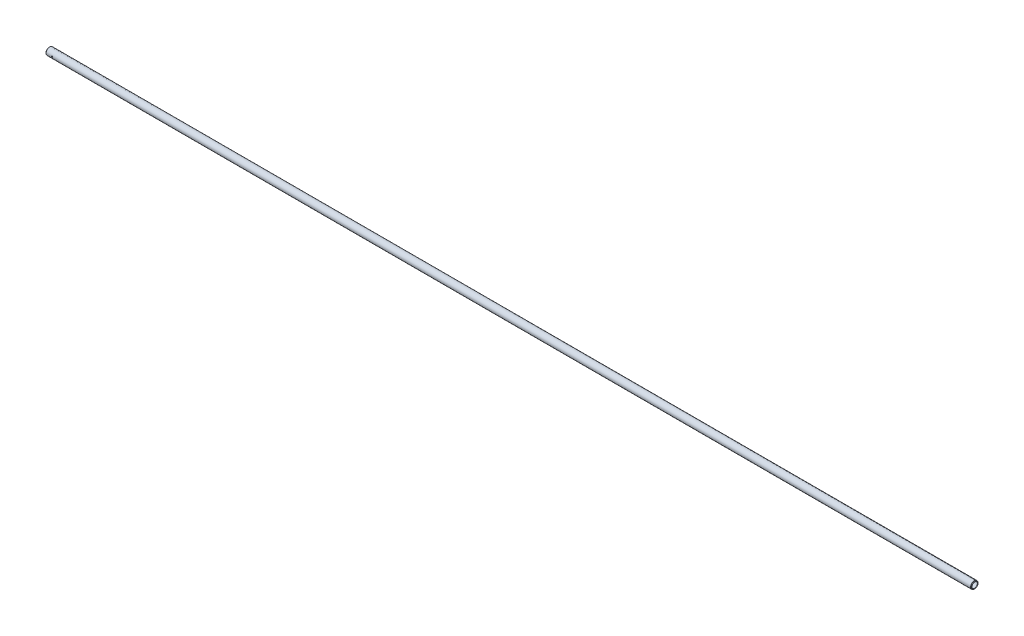
ISO-10303-21;
HEADER;
FILE_DESCRIPTION(('STEP AP214'),'2;1');
FILE_NAME('part.step','',(''),(''),'','','');
FILE_SCHEMA(('AUTOMOTIVE_DESIGN { 1 0 10303 214 1 1 1 1 }'));
ENDSEC;
DATA;
#1=APPLICATION_CONTEXT('core data for automotive mechanical design processes');
#2=APPLICATION_PROTOCOL_DEFINITION('international standard','automotive_design',2000,#1);
#3=PRODUCT_CONTEXT('',#1,'mechanical');
#4=PRODUCT('Part','Part','',(#3));
#5=PRODUCT_RELATED_PRODUCT_CATEGORY('part','',(#4));
#6=PRODUCT_DEFINITION_FORMATION('','',#4);
#7=PRODUCT_DEFINITION_CONTEXT('part definition',#1,'design');
#8=PRODUCT_DEFINITION('design','',#6,#7);
#9=PRODUCT_DEFINITION_SHAPE('','',#8);
#10=(LENGTH_UNIT() NAMED_UNIT(*) SI_UNIT(.MILLI.,.METRE.));
#11=(NAMED_UNIT(*) PLANE_ANGLE_UNIT() SI_UNIT($,.RADIAN.));
#12=(NAMED_UNIT(*) SI_UNIT($,.STERADIAN.) SOLID_ANGLE_UNIT());
#13=UNCERTAINTY_MEASURE_WITH_UNIT(LENGTH_MEASURE(1.E-05),#10,'distance_accuracy_value','');
#14=(GEOMETRIC_REPRESENTATION_CONTEXT(3) GLOBAL_UNCERTAINTY_ASSIGNED_CONTEXT((#13)) GLOBAL_UNIT_ASSIGNED_CONTEXT((#10,
#11,#12)) REPRESENTATION_CONTEXT('',''));
#15=CARTESIAN_POINT('',(0.,0.,0.));
#16=DIRECTION('',(0.,0.,1.));
#17=DIRECTION('',(1.,0.,0.));
#18=AXIS2_PLACEMENT_3D('',#15,#16,#17);
#19=CARTESIAN_POINT('',(1156.6271,0.,0.));
#20=DIRECTION('',(-1.,0.,0.));
#21=DIRECTION('',(0.,0.,1.));
#22=AXIS2_PLACEMENT_3D('',#19,#20,#21);
#23=CYLINDRICAL_SURFACE('',#22,4.08305);
#24=CARTESIAN_POINT('',(0.558800000000081,0.,0.));
#25=DIRECTION('',(-1.,0.,0.));
#26=DIRECTION('',(0.,0.,1.));
#27=AXIS2_PLACEMENT_3D('',#24,#25,#26);
#28=CIRCLE('',#27,4.08305);
#29=CARTESIAN_POINT('',(0.558800000000081,0.,4.08305));
#30=VERTEX_POINT('',#29);
#31=EDGE_CURVE('E57',#30,#30,#28,.T.);
#32=ORIENTED_EDGE('',*,*,#31,.T.);
#33=EDGE_LOOP('',(#32));
#34=FACE_BOUND('',#33,.T.);
#35=CARTESIAN_POINT('',(1156.0683,0.,0.));
#36=DIRECTION('',(-1.,0.,0.));
#37=DIRECTION('',(0.,0.,1.));
#38=AXIS2_PLACEMENT_3D('',#35,#36,#37);
#39=CIRCLE('',#38,4.08305);
#40=CARTESIAN_POINT('',(1156.0683,0.,4.08305));
#41=VERTEX_POINT('',#40);
#42=EDGE_CURVE('E60',#41,#41,#39,.T.);
#43=ORIENTED_EDGE('',*,*,#42,.F.);
#44=EDGE_LOOP('',(#43));
#45=FACE_BOUND('',#44,.T.);
#46=CARTESIAN_POINT('',(8.48360000000004,0.,4.08305));
#47=CARTESIAN_POINT('',(8.48359835195724,-0.0437936344189823,4.08304919974877));
#48=CARTESIAN_POINT('',(8.47993408105671,-0.0876084524201756,4.08233816632306));
#49=CARTESIAN_POINT('',(8.46538417488533,-0.174001819702679,4.07957026755408));
#50=CARTESIAN_POINT('',(8.45449259524058,-0.216579321191741,4.07751229438825));
#51=CARTESIAN_POINT('',(8.42583526652717,-0.299236266507052,4.07228055510989));
#52=CARTESIAN_POINT('',(8.40807588417276,-0.339317984181105,4.06910782266995));
#53=CARTESIAN_POINT('',(8.36620550580085,-0.415929567273147,4.06199237015643));
#54=CARTESIAN_POINT('',(8.34209496655685,-0.452459687862477,4.05804970546146));
#55=CARTESIAN_POINT('',(8.28788347201868,-0.521395994045053,4.04977333858839));
#56=CARTESIAN_POINT('',(8.25771780427946,-0.553750824259303,4.04543571561407));
#57=CARTESIAN_POINT('',(8.19239151171186,-0.612973668880685,4.03688716636423));
#58=CARTESIAN_POINT('',(8.15723051551213,-0.639841274984794,4.03267624953674));
#59=CARTESIAN_POINT('',(8.08254599955123,-0.687542698736716,4.0248197059621));
#60=CARTESIAN_POINT('',(8.04298828363569,-0.708323881900835,4.02117913015663));
#61=CARTESIAN_POINT('',(7.96086101610945,-0.742925508771729,4.01493090011621));
#62=CARTESIAN_POINT('',(7.91829174043,-0.756746589251585,4.01232315139357));
#63=CARTESIAN_POINT('',(7.83190052744974,-0.77687006133666,4.00847538546546));
#64=CARTESIAN_POINT('',(7.78810024710716,-0.783262244363182,4.0072190481824));
#65=CARTESIAN_POINT('',(7.7000322662954,-0.788625259864484,4.00616718302077));
#66=CARTESIAN_POINT('',(7.65576461060103,-0.787596796913966,4.00637151645457));
#67=CARTESIAN_POINT('',(7.56867168576739,-0.778220434855247,4.00820305985024));
#68=CARTESIAN_POINT('',(7.52583490586966,-0.76997498662024,4.00981035280903));
#69=CARTESIAN_POINT('',(7.44216430373261,-0.746560212158085,4.01423539756978));
#70=CARTESIAN_POINT('',(7.40133057114312,-0.731390576339592,4.01705320349536));
#71=CARTESIAN_POINT('',(7.32252731625151,-0.694458841021243,4.02360240659366));
#72=CARTESIAN_POINT('',(7.28457752130453,-0.672655693384622,4.02733946369727));
#73=CARTESIAN_POINT('',(7.21283663474116,-0.623104847461146,4.03530240057001));
#74=CARTESIAN_POINT('',(7.17904598933934,-0.595356512218259,4.03952833269392));
#75=CARTESIAN_POINT('',(7.11599098103806,-0.534152205023734,4.04807943821777));
#76=CARTESIAN_POINT('',(7.08681159779974,-0.500608682283266,4.05240509062216));
#77=CARTESIAN_POINT('',(7.03448086817903,-0.429058288709583,4.06060350875623));
#78=CARTESIAN_POINT('',(7.01132958905603,-0.391051368082271,4.06447626943244));
#79=CARTESIAN_POINT('',(6.97169838664311,-0.311561996442477,4.0713410630523));
#80=CARTESIAN_POINT('',(6.95522766956537,-0.270074843774468,4.07433187908588));
#81=CARTESIAN_POINT('',(6.92951301818015,-0.184852005608387,4.07908646983238));
#82=CARTESIAN_POINT('',(6.92026827100975,-0.14111657361356,4.0808503825595));
#83=CARTESIAN_POINT('',(6.90938711870488,-0.0533694181846439,4.08293335335446));
#84=CARTESIAN_POINT('',(6.90763433733887,-0.00937263398596386,4.08327450971812));
#85=CARTESIAN_POINT('',(6.91147417957213,0.0782852544433916,4.08253471293466));
#86=CARTESIAN_POINT('',(6.91706642050063,0.121946376042663,4.08145383387463));
#87=CARTESIAN_POINT('',(6.93534083660303,0.207321779676394,4.07800520422727));
#88=CARTESIAN_POINT('',(6.94796377800441,0.249049213016555,4.07564820951119));
#89=CARTESIAN_POINT('',(6.97987691246763,0.329795385236145,4.06991058909967));
#90=CARTESIAN_POINT('',(6.99916757829879,0.368813931808628,4.06652989082153));
#91=CARTESIAN_POINT('',(7.04412369970402,0.443528942367239,4.05906476357752));
#92=CARTESIAN_POINT('',(7.06985982649908,0.479182104559914,4.05497269805924));
#93=CARTESIAN_POINT('',(7.12688110870752,0.545705421390549,4.04655769873302));
#94=CARTESIAN_POINT('',(7.15816681440034,0.576575101143648,4.04223474206036));
#95=CARTESIAN_POINT('',(7.22592727552292,0.633100311742506,4.03377137624205));
#96=CARTESIAN_POINT('',(7.26246895201072,0.658676220685622,4.02963439872249));
#97=CARTESIAN_POINT('',(7.33939821996473,0.703327042099058,4.02208196015369));
#98=CARTESIAN_POINT('',(7.37978566354493,0.722402204421516,4.01866647137642));
#99=CARTESIAN_POINT('',(7.46306349579979,0.753398922517765,4.01297098512968));
#100=CARTESIAN_POINT('',(7.50594021700063,0.765356111849477,4.01068534143271));
#101=CARTESIAN_POINT('',(7.59314260188912,0.781886620041761,4.00749582041581));
#102=CARTESIAN_POINT('',(7.63746809083888,0.786460826045708,4.00659177708269));
#103=CARTESIAN_POINT('',(7.72551145378198,0.788064507393609,4.00627657296743));
#104=CARTESIAN_POINT('',(7.7692269984212,0.785219667989717,4.00684054243296));
#105=CARTESIAN_POINT('',(7.85554410908808,0.772342115181789,4.00934249603243));
#106=CARTESIAN_POINT('',(7.89814568270374,0.762309450752035,4.01128047080458));
#107=CARTESIAN_POINT('',(7.98095274124203,0.735395356982123,4.01630132737775));
#108=CARTESIAN_POINT('',(8.02116305151539,0.718528296610042,4.01938180597943));
#109=CARTESIAN_POINT('',(8.09820295037004,0.678438228458858,4.02634213533605));
#110=CARTESIAN_POINT('',(8.13503228088293,0.655214736034405,4.03022204703808));
#111=CARTESIAN_POINT('',(8.20489278875161,0.602637303179895,4.0384208109495));
#112=CARTESIAN_POINT('',(8.23785465657996,0.57319218541361,4.04274563650558));
#113=CARTESIAN_POINT('',(8.29841131313612,0.509196692661865,4.05130301207866));
#114=CARTESIAN_POINT('',(8.32600486737644,0.474645146618343,4.05553554067301));
#115=CARTESIAN_POINT('',(8.37529048033091,0.401019283517835,4.06347924655966));
#116=CARTESIAN_POINT('',(8.39692328475516,0.361904697981703,4.06718502347692));
#117=CARTESIAN_POINT('',(8.43327524597784,0.280536295709282,4.07360479031343));
#118=CARTESIAN_POINT('',(8.44800078686978,0.238285419723786,4.07631969553658));
#119=CARTESIAN_POINT('',(8.46718809046656,0.163268679567907,4.07990923899093));
#120=CARTESIAN_POINT('',(8.4733318487948,0.130936667131422,4.08108027210182));
#121=CARTESIAN_POINT('',(8.48153836498294,0.065740405913157,4.08265094217566));
#122=CARTESIAN_POINT('',(8.48360123719671,0.0328761720712113,4.08305060075392));
#123=CARTESIAN_POINT('',(8.48360000000004,0.,4.08305));
#124=B_SPLINE_CURVE_WITH_KNOTS('',3,(#46,#47,#48,#49,#50,#51,#52,#53,#54,#55,#56,#57,#58,#59,
#60,#61,#62,#63,#64,#65,#66,#67,#68,#69,#70,#71,#72,#73,#74,#75,#76,#77,#78,#79,#80,#81,#82,#83,
#84,#85,#86,#87,#88,#89,#90,#91,#92,#93,#94,#95,#96,#97,#98,#99,#100,#101,#102,#103,#104,#105,
#106,#107,#108,#109,#110,#111,#112,#113,#114,#115,#116,#117,#118,#119,#120,#121,#122,#123),
.UNSPECIFIED.,.T.,.F.,(4,2,2,2,2,2,2,2,2,2,2,2,2,2,2,2,2,2,2,2,2,2,2,2,2,2,2,2,2,2,2,2,2,2,2,2,
2,2,4),(0.,0.131260656054915,0.262629406447818,0.393876663832997,0.525114484526691,
0.657837688787557,0.790570765354721,0.924419923013575,1.05825683271639,1.19045868548511,
1.32264798613163,1.45299064480538,1.58333913187584,1.71451121118051,1.84569735104467,
1.97907353085009,2.11245119875435,2.24601204959702,2.37955787376561,2.51102155256385,
2.64247838246389,2.77284408281307,2.90321902852779,3.03509135907602,3.16697677300195,
3.30072101699543,3.4344601200325,3.56752394993548,3.70057178962414,3.83138037883361,
3.96218807678659,4.09272217355082,4.22326622564433,4.35587562612994,4.48851548527764,
4.62242986076684,4.75622021974921,4.85476122692794,4.95329947276878),.UNSPECIFIED.);
#125=CARTESIAN_POINT('',(8.48360000000004,0.,4.08305));
#126=VERTEX_POINT('',#125);
#127=EDGE_CURVE('E90',#126,#126,#124,.T.);
#128=ORIENTED_EDGE('',*,*,#127,.F.);
#129=EDGE_LOOP('',(#128));
#130=FACE_BOUND('',#129,.T.);
#131=ADVANCED_FACE('F33',(#34,#45,#130),#23,.F.);
#132=CARTESIAN_POINT('',(1156.6271,0.,0.));
#133=DIRECTION('',(-1.,0.,0.));
#134=DIRECTION('',(0.,0.,1.));
#135=AXIS2_PLACEMENT_3D('',#132,#133,#134);
#136=CYLINDRICAL_SURFACE('',#135,4.55930000000007);
#137=CARTESIAN_POINT('',(0.476249999999956,0.,0.));
#138=DIRECTION('',(-1.,0.,0.));
#139=DIRECTION('',(0.,0.,1.));
#140=AXIS2_PLACEMENT_3D('',#137,#138,#139);
#141=CIRCLE('',#140,4.5593);
#142=CARTESIAN_POINT('',(0.476249999999956,0.,4.5593));
#143=VERTEX_POINT('',#142);
#144=EDGE_CURVE('E81',#143,#143,#141,.T.);
#145=ORIENTED_EDGE('',*,*,#144,.F.);
#146=EDGE_LOOP('',(#145));
#147=FACE_BOUND('',#146,.T.);
#148=CARTESIAN_POINT('',(1156.15085000001,0.,0.));
#149=DIRECTION('',(-1.,0.,0.));
#150=DIRECTION('',(0.,0.,1.));
#151=AXIS2_PLACEMENT_3D('',#148,#149,#150);
#152=CIRCLE('',#151,4.55930000000015);
#153=CARTESIAN_POINT('',(1156.15085000001,0.,4.55930000000015));
#154=VERTEX_POINT('',#153);
#155=EDGE_CURVE('E78',#154,#154,#152,.T.);
#156=ORIENTED_EDGE('',*,*,#155,.T.);
#157=EDGE_LOOP('',(#156));
#158=FACE_BOUND('',#157,.T.);
#159=CARTESIAN_POINT('',(6.9088,0.,4.55930000000007));
#160=CARTESIAN_POINT('',(6.90880173788357,-0.0438787900934352,4.55929923353621));
#161=CARTESIAN_POINT('',(6.91248018742963,-0.0877809369843039,4.55865998246218));
#162=CARTESIAN_POINT('',(6.92708974630305,-0.174352292677961,4.55617145528336));
#163=CARTESIAN_POINT('',(6.93802737257788,-0.217020357627615,4.55432109191954));
#164=CARTESIAN_POINT('',(6.96681384540086,-0.299858653552695,4.54961772861648));
#165=CARTESIAN_POINT('',(6.98465687382452,-0.340030954346273,4.54676557292063));
#166=CARTESIAN_POINT('',(7.02673205191729,-0.41680684379291,4.54037162792106));
#167=CARTESIAN_POINT('',(7.05096353075956,-0.453410806591088,4.53682991103574));
#168=CARTESIAN_POINT('',(7.10539140319116,-0.522390296598196,4.52940846554749));
#169=CARTESIAN_POINT('',(7.13564041313099,-0.554724010397864,4.52552593738847));
#170=CARTESIAN_POINT('',(7.20113144986572,-0.613883826469434,4.51788169940716));
#171=CARTESIAN_POINT('',(7.23637380319597,-0.640709568271076,4.51411999750594));
#172=CARTESIAN_POINT('',(7.31114068119446,-0.688261307181512,4.50711619415512));
#173=CARTESIAN_POINT('',(7.35069208294203,-0.70894562384832,4.50387770829871));
#174=CARTESIAN_POINT('',(7.43277339434947,-0.743360744349523,4.49832603164418));
#175=CARTESIAN_POINT('',(7.47530308726337,-0.757092053593581,4.49601277359439));
#176=CARTESIAN_POINT('',(7.56168928316079,-0.777078944161335,4.4926014298857));
#177=CARTESIAN_POINT('',(7.60552856223666,-0.783406923968186,4.49149158382677));
#178=CARTESIAN_POINT('',(7.69365962128154,-0.78863206960421,4.49057718501921));
#179=CARTESIAN_POINT('',(7.73795136660974,-0.787529800098345,4.4907725330818));
#180=CARTESIAN_POINT('',(7.8252111356648,-0.777984633269266,4.49243572132274));
#181=CARTESIAN_POINT('',(7.86818839492277,-0.76962333990557,4.49388941499226));
#182=CARTESIAN_POINT('',(7.95212078342672,-0.745925661314894,4.49788333503316));
#183=CARTESIAN_POINT('',(7.99307583861122,-0.730589020831555,4.50042360116645));
#184=CARTESIAN_POINT('',(8.0720440118033,-0.693294083354735,4.50631958692552));
#185=CARTESIAN_POINT('',(8.11004092885805,-0.671302161271533,4.50967943025437));
#186=CARTESIAN_POINT('',(8.18183610347961,-0.621344777516162,4.51683317719874));
#187=CARTESIAN_POINT('',(8.2156339974003,-0.593378799045016,4.52062711835366));
#188=CARTESIAN_POINT('',(8.27854385126821,-0.531823825442162,4.5282835963603));
#189=CARTESIAN_POINT('',(8.30758737594874,-0.498164874202758,4.53214637364789));
#190=CARTESIAN_POINT('',(8.35962497710523,-0.426415303229937,4.5394586362793));
#191=CARTESIAN_POINT('',(8.38261900908187,-0.388324650900455,4.54290811858287));
#192=CARTESIAN_POINT('',(8.42191220004142,-0.308726630945105,4.54901057156252));
#193=CARTESIAN_POINT('',(8.438205015904,-0.267216070558901,4.55166278693955));
#194=CARTESIAN_POINT('',(8.46356819959517,-0.181991605697949,4.55586588028001));
#195=CARTESIAN_POINT('',(8.47263921676209,-0.138277899691968,4.55741685725846));
#196=CARTESIAN_POINT('',(8.48320784871207,-0.0504775616651755,4.55922932700289));
#197=CARTESIAN_POINT('',(8.48479935994239,-0.00640255077836448,4.55950680600306));
#198=CARTESIAN_POINT('',(8.48061456137249,0.0813841709335896,4.55878490443551));
#199=CARTESIAN_POINT('',(8.47483855673372,0.12509589673047,4.55778557675294));
#200=CARTESIAN_POINT('',(8.45616077958018,0.210623034531852,4.55463225936082));
#201=CARTESIAN_POINT('',(8.44330577902661,0.252448964527875,4.55248585129895));
#202=CARTESIAN_POINT('',(8.41088498603065,0.333352024912502,4.54727805560056));
#203=CARTESIAN_POINT('',(8.39131879400666,0.372428991461956,4.5442166134847));
#204=CARTESIAN_POINT('',(8.34581799505181,0.447130754480508,4.53747859942565));
#205=CARTESIAN_POINT('',(8.3198250897917,0.482719533173578,4.53379650052401));
#206=CARTESIAN_POINT('',(8.26228853544257,0.549063646557849,4.52624154746749));
#207=CARTESIAN_POINT('',(8.23074445147513,0.579818602210547,4.52236867838482));
#208=CARTESIAN_POINT('',(8.16257869763466,0.635972549386746,4.51481661249048));
#209=CARTESIAN_POINT('',(8.12590427541414,0.66130791700256,4.51114006038156));
#210=CARTESIAN_POINT('',(8.04876488870884,0.705458337657419,4.50444732852059));
#211=CARTESIAN_POINT('',(8.00830005068168,0.724273608124612,4.50143112674883));
#212=CARTESIAN_POINT('',(7.92490181502537,0.754755945844598,4.49642070180106));
#213=CARTESIAN_POINT('',(7.88198001463222,0.766453982667553,4.49442205717205));
#214=CARTESIAN_POINT('',(7.79474306677856,0.782466746567234,4.4916622146107));
#215=CARTESIAN_POINT('',(7.75042805071584,0.78678216780306,4.49090090033726));
#216=CARTESIAN_POINT('',(7.6622984592408,0.787886756489596,4.49070718207796));
#217=CARTESIAN_POINT('',(7.61848514660811,0.784776124527753,4.49125708556024));
#218=CARTESIAN_POINT('',(7.5320154781723,0.771334325366263,4.49358494042037));
#219=CARTESIAN_POINT('',(7.48935911780055,0.761003186683537,4.49536288694814));
#220=CARTESIAN_POINT('',(7.40645718548201,0.73345312746822,4.49993956987469));
#221=CARTESIAN_POINT('',(7.36620845948053,0.716243455691915,4.50273693513685));
#222=CARTESIAN_POINT('',(7.28915337849649,0.675435310315805,4.50903848231052));
#223=CARTESIAN_POINT('',(7.25234721490281,0.651836481795205,4.51254270348547));
#224=CARTESIAN_POINT('',(7.1827169833407,0.598564857782336,4.5199188942483));
#225=CARTESIAN_POINT('',(7.1499495776925,0.568818558610237,4.52379497772685));
#226=CARTESIAN_POINT('',(7.08983737931834,0.504250969968621,4.53144592165509));
#227=CARTESIAN_POINT('',(7.06249383738638,0.469428513094012,4.53522075858321));
#228=CARTESIAN_POINT('',(7.01381753322901,0.395387001782438,4.54227670178684));
#229=CARTESIAN_POINT('',(6.9925312115866,0.356137039272709,4.54555390803264));
#230=CARTESIAN_POINT('',(6.95688744867501,0.274576761939379,4.55120738787061));
#231=CARTESIAN_POINT('',(6.94252321488556,0.232269494279871,4.55358454417256));
#232=CARTESIAN_POINT('',(6.92419365868989,0.158173717552972,4.55666073631601));
#233=CARTESIAN_POINT('',(6.91843045127705,0.126829512472878,4.55764508784359));
#234=CARTESIAN_POINT('',(6.91073302843319,0.0636609640193508,4.55896499147861));
#235=CARTESIAN_POINT('',(6.90879873906377,0.0318366299294147,4.55930055611446));
#236=CARTESIAN_POINT('',(6.9088,0.,4.55930000000007));
#237=B_SPLINE_CURVE_WITH_KNOTS('',3,(#159,#160,#161,#162,#163,#164,#165,#166,#167,#168,#169,
#170,#171,#172,#173,#174,#175,#176,#177,#178,#179,#180,#181,#182,#183,#184,#185,#186,#187,#188,
#189,#190,#191,#192,#193,#194,#195,#196,#197,#198,#199,#200,#201,#202,#203,#204,#205,#206,#207,
#208,#209,#210,#211,#212,#213,#214,#215,#216,#217,#218,#219,#220,#221,#222,#223,#224,#225,#226,
#227,#228,#229,#230,#231,#232,#233,#234,#235,#236),.UNSPECIFIED.,.T.,.F.,(4,2,2,2,2,2,2,2,2,2,2,
2,2,2,2,2,2,2,2,2,2,2,2,2,2,2,2,2,2,2,2,2,2,2,2,2,2,2,4),(0.,0.131519982800701,0.26315819805918,
0.394685742578751,0.526199481388945,0.658918145413018,0.791645492468371,0.925254054558016,
1.05885290333206,1.19113404545616,1.32340513493186,1.45420824554892,1.58501614316969,
1.71649629145712,1.84798781833529,1.98123133306715,2.11447582789417,2.24784615830952,
2.38120449555626,2.51288412112274,2.64455829271503,2.7753727343096,2.90619496589514,
3.03825050437787,3.1703163926785,3.30385659425637,3.43739234218997,3.57034279433952,
3.70328074497947,3.83443510866859,3.96558895437506,4.09656704296611,4.22755240894771,
4.36020537034356,4.49288888728622,4.62656384493448,4.76010736128772,4.85553464791699,
4.95096009177797),.UNSPECIFIED.);
#238=CARTESIAN_POINT('',(6.9088,0.,4.55930000000007));
#239=VERTEX_POINT('',#238);
#240=EDGE_CURVE('E10',#239,#239,#237,.T.);
#241=ORIENTED_EDGE('',*,*,#240,.F.);
#242=EDGE_LOOP('',(#241));
#243=FACE_BOUND('',#242,.T.);
#244=ADVANCED_FACE('F111',(#147,#158,#243),#136,.T.);
#245=CARTESIAN_POINT('',(-0.355226146905763,0.,0.));
#246=DIRECTION('',(-1.,0.,0.));
#247=DIRECTION('',(0.,0.,1.));
#248=AXIS2_PLACEMENT_3D('',#245,#246,#247);
#249=TOROIDAL_SURFACE('',#248,3.77968126932705,0.126999999999896);
#250=CARTESIAN_POINT('',(-0.445028708116357,0.,0.));
#251=DIRECTION('',(-1.,0.,0.));
#252=DIRECTION('',(0.,0.,1.));
#253=AXIS2_PLACEMENT_3D('',#250,#251,#252);
#254=CIRCLE('',#253,3.6898787081164);
#255=CARTESIAN_POINT('',(-0.445028708116357,0.,3.6898787081164));
#256=VERTEX_POINT('',#255);
#257=EDGE_CURVE('E44',#256,#256,#254,.T.);
#258=ORIENTED_EDGE('',*,*,#257,.F.);
#259=EDGE_LOOP('',(#258));
#260=FACE_BOUND('',#259,.T.);
#261=CARTESIAN_POINT('',(-0.445028708116357,0.,0.));
#262=DIRECTION('',(-1.,0.,0.));
#263=DIRECTION('',(0.,0.,1.));
#264=AXIS2_PLACEMENT_3D('',#261,#262,#263);
#265=CIRCLE('',#264,3.8694838305377);
#266=CARTESIAN_POINT('',(-0.445028708116357,0.,3.8694838305377));
#267=VERTEX_POINT('',#266);
#268=EDGE_CURVE('E87',#267,#267,#265,.T.);
#269=ORIENTED_EDGE('',*,*,#268,.T.);
#270=EDGE_LOOP('',(#269));
#271=FACE_BOUND('',#270,.T.);
#272=ADVANCED_FACE('F35',(#260,#271),#249,.T.);
#273=CARTESIAN_POINT('',(-0.445028708116357,0.,0.));
#274=DIRECTION('',(-1.,0.,0.));
#275=DIRECTION('',(0.,0.,1.));
#276=AXIS2_PLACEMENT_3D('',#273,#274,#275);
#277=CONICAL_SURFACE('',#276,3.6898787081164,0.785398163397365);
#278=CARTESIAN_POINT('',(-0.27939999999993,0.,0.));
#279=DIRECTION('',(-1.,0.,0.));
#280=DIRECTION('',(0.,0.,1.));
#281=AXIS2_PLACEMENT_3D('',#278,#279,#280);
#282=CIRCLE('',#281,3.52425);
#283=CARTESIAN_POINT('',(-0.27939999999993,0.,3.52425));
#284=VERTEX_POINT('',#283);
#285=EDGE_CURVE('E48',#284,#284,#282,.T.);
#286=ORIENTED_EDGE('',*,*,#285,.F.);
#287=EDGE_LOOP('',(#286));
#288=FACE_BOUND('',#287,.T.);
#289=ORIENTED_EDGE('',*,*,#257,.T.);
#290=EDGE_LOOP('',(#289));
#291=FACE_BOUND('',#290,.T.);
#292=ADVANCED_FACE('F160',(#288,#291),#277,.F.);
#293=CARTESIAN_POINT('',(1156.6271,0.,0.));
#294=DIRECTION('',(-1.,0.,0.));
#295=DIRECTION('',(0.,0.,1.));
#296=AXIS2_PLACEMENT_3D('',#293,#294,#295);
#297=CYLINDRICAL_SURFACE('',#296,3.52425);
#298=CARTESIAN_POINT('',(0.,0.,0.));
#299=DIRECTION('',(-1.,0.,0.));
#300=DIRECTION('',(0.,0.,1.));
#301=AXIS2_PLACEMENT_3D('',#298,#299,#300);
#302=CIRCLE('',#301,3.52425);
#303=CARTESIAN_POINT('',(0.,0.,3.52425));
#304=VERTEX_POINT('',#303);
#305=EDGE_CURVE('E52',#304,#304,#302,.T.);
#306=ORIENTED_EDGE('',*,*,#305,.F.);
#307=EDGE_LOOP('',(#306));
#308=FACE_BOUND('',#307,.T.);
#309=ORIENTED_EDGE('',*,*,#285,.T.);
#310=EDGE_LOOP('',(#309));
#311=FACE_BOUND('',#310,.T.);
#312=ADVANCED_FACE('F141',(#308,#311),#297,.F.);
#313=CARTESIAN_POINT('',(0.,0.,0.));
#314=DIRECTION('',(1.,0.,0.));
#315=DIRECTION('',(0.,0.,-1.));
#316=AXIS2_PLACEMENT_3D('',#313,#314,#315);
#317=CONICAL_SURFACE('',#316,3.52425,0.785398163397376);
#318=ORIENTED_EDGE('',*,*,#31,.F.);
#319=EDGE_LOOP('',(#318));
#320=FACE_BOUND('',#319,.T.);
#321=ORIENTED_EDGE('',*,*,#305,.T.);
#322=EDGE_LOOP('',(#321));
#323=FACE_BOUND('',#322,.T.);
#324=ADVANCED_FACE('F136',(#320,#323),#317,.F.);
#325=CARTESIAN_POINT('',(1156.0683,0.,0.));
#326=DIRECTION('',(-1.,0.,0.));
#327=DIRECTION('',(0.,0.,1.));
#328=AXIS2_PLACEMENT_3D('',#325,#326,#327);
#329=CONICAL_SURFACE('',#328,4.08305,0.785398163397376);
#330=CARTESIAN_POINT('',(1156.6271,0.,0.));
#331=DIRECTION('',(-1.,0.,0.));
#332=DIRECTION('',(0.,0.,1.));
#333=AXIS2_PLACEMENT_3D('',#330,#331,#332);
#334=CIRCLE('',#333,3.52425);
#335=CARTESIAN_POINT('',(1156.6271,0.,3.52425));
#336=VERTEX_POINT('',#335);
#337=EDGE_CURVE('E63',#336,#336,#334,.T.);
#338=ORIENTED_EDGE('',*,*,#337,.F.);
#339=EDGE_LOOP('',(#338));
#340=FACE_BOUND('',#339,.T.);
#341=ORIENTED_EDGE('',*,*,#42,.T.);
#342=EDGE_LOOP('',(#341));
#343=FACE_BOUND('',#342,.T.);
#344=ADVANCED_FACE('F133',(#340,#343),#329,.F.);
#345=CARTESIAN_POINT('',(1156.6271,0.,0.));
#346=DIRECTION('',(-1.,0.,0.));
#347=DIRECTION('',(0.,0.,1.));
#348=AXIS2_PLACEMENT_3D('',#345,#346,#347);
#349=CYLINDRICAL_SURFACE('',#348,3.52425);
#350=CARTESIAN_POINT('',(1156.9065,0.,0.));
#351=DIRECTION('',(-1.,0.,0.));
#352=DIRECTION('',(0.,0.,1.));
#353=AXIS2_PLACEMENT_3D('',#350,#351,#352);
#354=CIRCLE('',#353,3.52425);
#355=CARTESIAN_POINT('',(1156.9065,0.,3.52425));
#356=VERTEX_POINT('',#355);
#357=EDGE_CURVE('E66',#356,#356,#354,.T.);
#358=ORIENTED_EDGE('',*,*,#357,.F.);
#359=EDGE_LOOP('',(#358));
#360=FACE_BOUND('',#359,.T.);
#361=ORIENTED_EDGE('',*,*,#337,.T.);
#362=EDGE_LOOP('',(#361));
#363=FACE_BOUND('',#362,.T.);
#364=ADVANCED_FACE('F130',(#360,#363),#349,.F.);
#365=CARTESIAN_POINT('',(1156.9065,0.,0.));
#366=DIRECTION('',(1.,0.,0.));
#367=DIRECTION('',(0.,0.,-1.));
#368=AXIS2_PLACEMENT_3D('',#365,#366,#367);
#369=CONICAL_SURFACE('',#368,3.52425,0.785398163396803);
#370=CARTESIAN_POINT('',(1157.07212870812,0.,0.));
#371=DIRECTION('',(-1.,0.,0.));
#372=DIRECTION('',(0.,0.,1.));
#373=AXIS2_PLACEMENT_3D('',#370,#371,#372);
#374=CIRCLE('',#373,3.68987870812265);
#375=CARTESIAN_POINT('',(1157.07212870812,0.,3.68987870812265));
#376=VERTEX_POINT('',#375);
#377=EDGE_CURVE('E69',#376,#376,#374,.T.);
#378=ORIENTED_EDGE('',*,*,#377,.F.);
#379=EDGE_LOOP('',(#378));
#380=FACE_BOUND('',#379,.T.);
#381=ORIENTED_EDGE('',*,*,#357,.T.);
#382=EDGE_LOOP('',(#381));
#383=FACE_BOUND('',#382,.T.);
#384=ADVANCED_FACE('F126',(#380,#383),#369,.F.);
#385=CARTESIAN_POINT('',(1156.98232614693,0.,0.));
#386=DIRECTION('',(-1.,0.,0.));
#387=DIRECTION('',(0.,0.,1.));
#388=AXIS2_PLACEMENT_3D('',#385,#386,#387);
#389=TOROIDAL_SURFACE('',#388,3.77968126931349,0.126999999974099);
#390=CARTESIAN_POINT('',(1157.07212870812,0.,0.));
#391=DIRECTION('',(-1.,0.,0.));
#392=DIRECTION('',(0.,0.,1.));
#393=AXIS2_PLACEMENT_3D('',#390,#391,#392);
#394=CIRCLE('',#393,3.86948383050437);
#395=CARTESIAN_POINT('',(1157.07212870812,0.,3.86948383050437));
#396=VERTEX_POINT('',#395);
#397=EDGE_CURVE('E72',#396,#396,#394,.T.);
#398=ORIENTED_EDGE('',*,*,#397,.F.);
#399=EDGE_LOOP('',(#398));
#400=FACE_BOUND('',#399,.T.);
#401=ORIENTED_EDGE('',*,*,#377,.T.);
#402=EDGE_LOOP('',(#401));
#403=FACE_BOUND('',#402,.T.);
#404=ADVANCED_FACE('F122',(#400,#403),#389,.T.);
#405=CARTESIAN_POINT('',(1157.07212870812,0.,0.));
#406=DIRECTION('',(-1.,0.,0.));
#407=DIRECTION('',(0.,0.,1.));
#408=AXIS2_PLACEMENT_3D('',#405,#406,#407);
#409=CONICAL_SURFACE('',#408,3.86948383050437,0.785398163397481);
#410=CARTESIAN_POINT('',(1156.54598126927,0.,0.));
#411=DIRECTION('',(-1.,0.,0.));
#412=DIRECTION('',(0.,0.,1.));
#413=AXIS2_PLACEMENT_3D('',#410,#411,#412);
#414=CIRCLE('',#413,4.39563126935689);
#415=CARTESIAN_POINT('',(1156.54598126927,0.,4.39563126935689));
#416=VERTEX_POINT('',#415);
#417=EDGE_CURVE('E75',#416,#416,#414,.T.);
#418=ORIENTED_EDGE('',*,*,#417,.F.);
#419=EDGE_LOOP('',(#418));
#420=FACE_BOUND('',#419,.T.);
#421=ORIENTED_EDGE('',*,*,#397,.T.);
#422=EDGE_LOOP('',(#421));
#423=FACE_BOUND('',#422,.T.);
#424=ADVANCED_FACE('F118',(#420,#423),#409,.T.);
#425=CARTESIAN_POINT('',(1156.15085000001,0.,0.));
#426=DIRECTION('',(-1.,0.,0.));
#427=DIRECTION('',(0.,0.,1.));
#428=AXIS2_PLACEMENT_3D('',#425,#426,#427);
#429=TOROIDAL_SURFACE('',#428,4.00050000010136,0.558799999898769);
#430=ORIENTED_EDGE('',*,*,#155,.F.);
#431=EDGE_LOOP('',(#430));
#432=FACE_BOUND('',#431,.T.);
#433=ORIENTED_EDGE('',*,*,#417,.T.);
#434=EDGE_LOOP('',(#433));
#435=FACE_BOUND('',#434,.T.);
#436=ADVANCED_FACE('F109',(#432,#435),#429,.T.);
#437=CARTESIAN_POINT('',(0.476250000000095,0.,0.));
#438=DIRECTION('',(-1.,0.,0.));
#439=DIRECTION('',(0.,0.,1.));
#440=AXIS2_PLACEMENT_3D('',#437,#438,#439);
#441=TOROIDAL_SURFACE('',#440,4.00049999999988,0.558800000000125);
#442=CARTESIAN_POINT('',(0.0811187306728467,0.,0.));
#443=DIRECTION('',(-1.,0.,0.));
#444=DIRECTION('',(0.,0.,1.));
#445=AXIS2_PLACEMENT_3D('',#442,#443,#444);
#446=CIRCLE('',#445,4.395631269327);
#447=CARTESIAN_POINT('',(0.0811187306728467,0.,4.395631269327));
#448=VERTEX_POINT('',#447);
#449=EDGE_CURVE('E84',#448,#448,#446,.T.);
#450=ORIENTED_EDGE('',*,*,#449,.F.);
#451=EDGE_LOOP('',(#450));
#452=FACE_BOUND('',#451,.T.);
#453=ORIENTED_EDGE('',*,*,#144,.T.);
#454=EDGE_LOOP('',(#453));
#455=FACE_BOUND('',#454,.T.);
#456=ADVANCED_FACE('F106',(#452,#455),#441,.T.);
#457=CARTESIAN_POINT('',(0.0811187306728467,0.,0.));
#458=DIRECTION('',(1.,0.,0.));
#459=DIRECTION('',(0.,0.,-1.));
#460=AXIS2_PLACEMENT_3D('',#457,#458,#459);
#461=CONICAL_SURFACE('',#460,4.395631269327,0.785398163397539);
#462=ORIENTED_EDGE('',*,*,#268,.F.);
#463=EDGE_LOOP('',(#462));
#464=FACE_BOUND('',#463,.T.);
#465=ORIENTED_EDGE('',*,*,#449,.T.);
#466=EDGE_LOOP('',(#465));
#467=FACE_BOUND('',#466,.T.);
#468=ADVANCED_FACE('F102',(#464,#467),#461,.T.);
#469=CARTESIAN_POINT('',(7.6962,0.,4.5593));
#470=DIRECTION('',(0.,0.,-1.));
#471=DIRECTION('',(-1.,0.,0.));
#472=AXIS2_PLACEMENT_3D('',#469,#470,#471);
#473=CYLINDRICAL_SURFACE('',#472,0.787400000000001);
#474=ORIENTED_EDGE('',*,*,#240,.T.);
#475=EDGE_LOOP('',(#474));
#476=FACE_BOUND('',#475,.T.);
#477=ORIENTED_EDGE('',*,*,#127,.T.);
#478=EDGE_LOOP('',(#477));
#479=FACE_BOUND('',#478,.T.);
#480=ADVANCED_FACE('F98',(#476,#479),#473,.F.);
#481=CLOSED_SHELL('',(#131,#244,#272,#292,#312,#324,#344,#364,#384,#404,#424,#436,#456,#468,#480));
#482=MANIFOLD_SOLID_BREP('B2',#481);
#483=ADVANCED_BREP_SHAPE_REPRESENTATION('',(#18,#482),#14);
#484=SHAPE_DEFINITION_REPRESENTATION(#9,#483);
ENDSEC;
END-ISO-10303-21;
